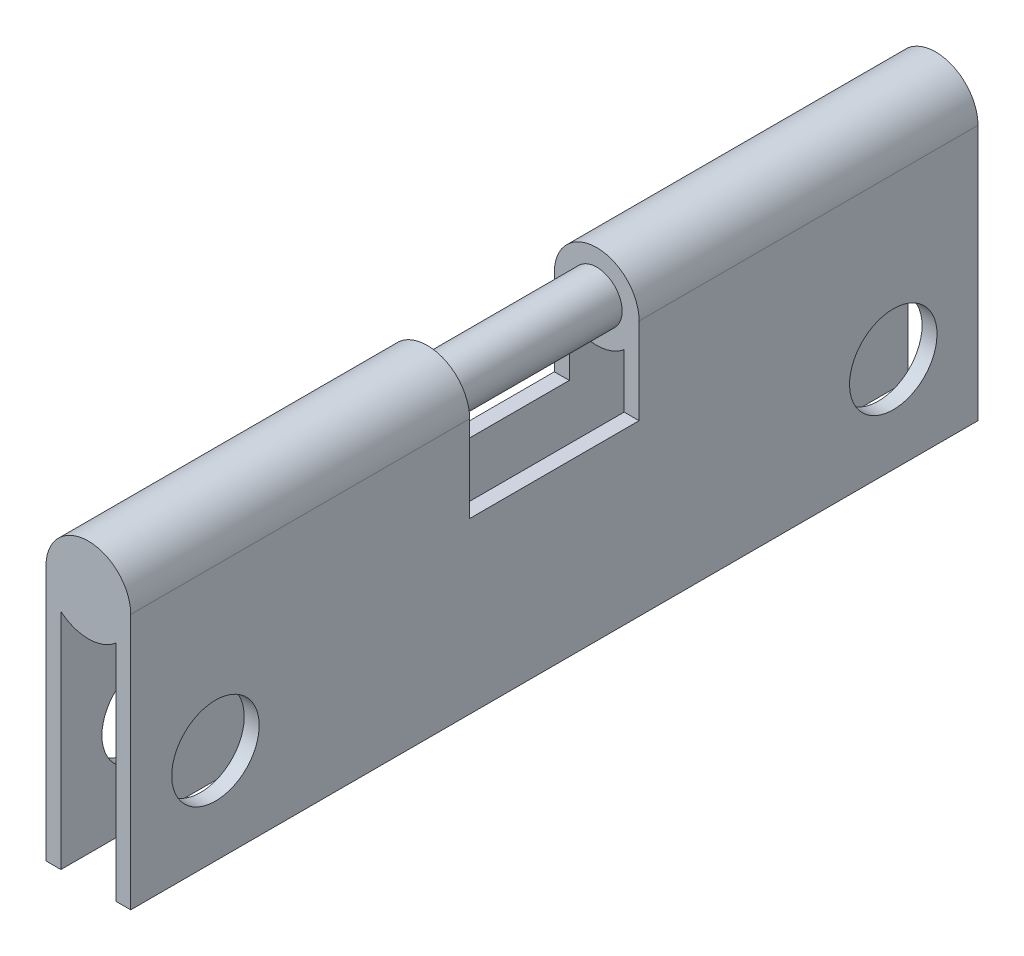
ISO-10303-21;
HEADER;
FILE_DESCRIPTION(('STEP AP214'),'2;1');
FILE_NAME('part.step','',(''),(''),'','','');
FILE_SCHEMA(('AUTOMOTIVE_DESIGN { 1 0 10303 214 1 1 1 1 }'));
ENDSEC;
DATA;
#1=APPLICATION_CONTEXT('core data for automotive mechanical design processes');
#2=APPLICATION_PROTOCOL_DEFINITION('international standard','automotive_design',2000,#1);
#3=PRODUCT_CONTEXT('',#1,'mechanical');
#4=PRODUCT('Part','Part','',(#3));
#5=PRODUCT_RELATED_PRODUCT_CATEGORY('part','',(#4));
#6=PRODUCT_DEFINITION_FORMATION('','',#4);
#7=PRODUCT_DEFINITION_CONTEXT('part definition',#1,'design');
#8=PRODUCT_DEFINITION('design','',#6,#7);
#9=PRODUCT_DEFINITION_SHAPE('','',#8);
#10=(LENGTH_UNIT() NAMED_UNIT(*) SI_UNIT(.MILLI.,.METRE.));
#11=(NAMED_UNIT(*) PLANE_ANGLE_UNIT() SI_UNIT($,.RADIAN.));
#12=(NAMED_UNIT(*) SI_UNIT($,.STERADIAN.) SOLID_ANGLE_UNIT());
#13=UNCERTAINTY_MEASURE_WITH_UNIT(LENGTH_MEASURE(1.E-05),#10,'distance_accuracy_value','');
#14=(GEOMETRIC_REPRESENTATION_CONTEXT(3) GLOBAL_UNCERTAINTY_ASSIGNED_CONTEXT((#13)) GLOBAL_UNIT_ASSIGNED_CONTEXT((#10,
#11,#12)) REPRESENTATION_CONTEXT('',''));
#15=CARTESIAN_POINT('',(0.,0.,0.));
#16=DIRECTION('',(0.,0.,1.));
#17=DIRECTION('',(1.,0.,0.));
#18=AXIS2_PLACEMENT_3D('',#15,#16,#17);
#19=CARTESIAN_POINT('',(0.,0.,31.75));
#20=DIRECTION('',(0.,0.,-1.));
#21=DIRECTION('',(-1.,0.,0.));
#22=AXIS2_PLACEMENT_3D('',#19,#20,#21);
#23=CYLINDRICAL_SURFACE('',#22,1.5875);
#24=DIRECTION('',(0.,0.,-1.));
#25=VECTOR('',#24,1.);
#26=CARTESIAN_POINT('',(1.5875,0.,31.75));
#27=LINE('',#26,#25);
#28=CARTESIAN_POINT('',(1.5875,0.,31.75));
#29=VERTEX_POINT('',#28);
#30=CARTESIAN_POINT('',(1.5875,0.,19.05));
#31=VERTEX_POINT('',#30);
#32=EDGE_CURVE('E301',#29,#31,#27,.T.);
#33=ORIENTED_EDGE('',*,*,#32,.T.);
#34=CARTESIAN_POINT('',(0.,0.,19.05));
#35=DIRECTION('',(0.,0.,1.));
#36=DIRECTION('',(1.,0.,0.));
#37=AXIS2_PLACEMENT_3D('',#34,#35,#36);
#38=CIRCLE('',#37,1.5875);
#39=CARTESIAN_POINT('',(-1.5875,0.,19.05));
#40=VERTEX_POINT('',#39);
#41=EDGE_CURVE('E228',#31,#40,#38,.T.);
#42=ORIENTED_EDGE('',*,*,#41,.T.);
#43=DIRECTION('',(0.,0.,-1.));
#44=VECTOR('',#43,1.);
#45=CARTESIAN_POINT('',(-1.5875,0.,31.75));
#46=LINE('',#45,#44);
#47=CARTESIAN_POINT('',(-1.5875,0.,31.75));
#48=VERTEX_POINT('',#47);
#49=EDGE_CURVE('E177',#48,#40,#46,.T.);
#50=ORIENTED_EDGE('',*,*,#49,.F.);
#51=CARTESIAN_POINT('',(0.,0.,31.75));
#52=DIRECTION('',(0.,0.,1.));
#53=DIRECTION('',(1.,0.,0.));
#54=AXIS2_PLACEMENT_3D('',#51,#52,#53);
#55=CIRCLE('',#54,1.5875);
#56=EDGE_CURVE('E248',#29,#48,#55,.T.);
#57=ORIENTED_EDGE('',*,*,#56,.F.);
#58=EDGE_LOOP('',(#33,#42,#50,#57));
#59=FACE_BOUND('',#58,.T.);
#60=ADVANCED_FACE('F39',(#59),#23,.T.);
#61=CARTESIAN_POINT('',(0.,0.,31.75));
#62=DIRECTION('',(0.,0.,-1.));
#63=DIRECTION('',(-1.,0.,0.));
#64=AXIS2_PLACEMENT_3D('',#61,#62,#63);
#65=CYLINDRICAL_SURFACE('',#64,1.5875);
#66=DIRECTION('',(0.,0.,-1.));
#67=VECTOR('',#66,1.);
#68=CARTESIAN_POINT('',(-1.0287,-1.20910403191785,31.75));
#69=LINE('',#68,#67);
#70=CARTESIAN_POINT('',(-1.0287,-1.20910403191785,31.75));
#71=VERTEX_POINT('',#70);
#72=CARTESIAN_POINT('',(-1.0287,-1.20910403191785,19.05));
#73=VERTEX_POINT('',#72);
#74=EDGE_CURVE('E319',#71,#73,#69,.T.);
#75=ORIENTED_EDGE('',*,*,#74,.T.);
#76=CARTESIAN_POINT('',(0.,0.,19.05));
#77=DIRECTION('',(0.,0.,1.));
#78=DIRECTION('',(1.,0.,0.));
#79=AXIS2_PLACEMENT_3D('',#76,#77,#78);
#80=CIRCLE('',#79,1.5875);
#81=CARTESIAN_POINT('',(1.0287,-1.20910403191785,19.05));
#82=VERTEX_POINT('',#81);
#83=EDGE_CURVE('E222',#73,#82,#80,.T.);
#84=ORIENTED_EDGE('',*,*,#83,.T.);
#85=DIRECTION('',(0.,0.,-1.));
#86=VECTOR('',#85,1.);
#87=CARTESIAN_POINT('',(1.0287,-1.20910403191785,31.75));
#88=LINE('',#87,#86);
#89=CARTESIAN_POINT('',(1.0287,-1.20910403191785,31.75));
#90=VERTEX_POINT('',#89);
#91=EDGE_CURVE('E314',#90,#82,#88,.T.);
#92=ORIENTED_EDGE('',*,*,#91,.F.);
#93=CARTESIAN_POINT('',(0.,0.,31.75));
#94=DIRECTION('',(0.,0.,1.));
#95=DIRECTION('',(1.,0.,0.));
#96=AXIS2_PLACEMENT_3D('',#93,#94,#95);
#97=CIRCLE('',#96,1.5875);
#98=EDGE_CURVE('E262',#71,#90,#97,.T.);
#99=ORIENTED_EDGE('',*,*,#98,.F.);
#100=EDGE_LOOP('',(#75,#84,#92,#99));
#101=FACE_BOUND('',#100,.T.);
#102=ADVANCED_FACE('F403',(#101),#65,.T.);
#103=CARTESIAN_POINT('',(-1.5875,0.,12.7));
#104=VERTEX_POINT('',#103);
#105=CARTESIAN_POINT('',(-1.5875,0.,0.));
#106=VERTEX_POINT('',#105);
#107=EDGE_CURVE('E331',#104,#106,#46,.T.);
#108=ORIENTED_EDGE('',*,*,#107,.F.);
#109=CARTESIAN_POINT('',(0.,0.,12.7));
#110=DIRECTION('',(0.,0.,-1.));
#111=DIRECTION('',(-1.,0.,0.));
#112=AXIS2_PLACEMENT_3D('',#109,#110,#111);
#113=CIRCLE('',#112,1.5875);
#114=CARTESIAN_POINT('',(1.5875,0.,12.7));
#115=VERTEX_POINT('',#114);
#116=EDGE_CURVE('E215',#104,#115,#113,.T.);
#117=ORIENTED_EDGE('',*,*,#116,.T.);
#118=CARTESIAN_POINT('',(1.5875,0.,0.));
#119=VERTEX_POINT('',#118);
#120=EDGE_CURVE('E274',#115,#119,#27,.T.);
#121=ORIENTED_EDGE('',*,*,#120,.T.);
#122=CARTESIAN_POINT('',(0.,0.,0.));
#123=DIRECTION('',(0.,0.,1.));
#124=DIRECTION('',(1.,0.,0.));
#125=AXIS2_PLACEMENT_3D('',#122,#123,#124);
#126=CIRCLE('',#125,1.5875);
#127=EDGE_CURVE('E247',#119,#106,#126,.T.);
#128=ORIENTED_EDGE('',*,*,#127,.T.);
#129=EDGE_LOOP('',(#108,#117,#121,#128));
#130=FACE_BOUND('',#129,.T.);
#131=ADVANCED_FACE('F41',(#130),#23,.T.);
#132=CARTESIAN_POINT('',(-1.5875,0.,31.75));
#133=DIRECTION('',(1.,0.,0.));
#134=DIRECTION('',(0.,1.,0.));
#135=AXIS2_PLACEMENT_3D('',#132,#133,#134);
#136=PLANE('',#135);
#137=CARTESIAN_POINT('',(-1.5875,-6.0071,28.575));
#138=DIRECTION('',(1.,0.,0.));
#139=DIRECTION('',(0.,1.,0.));
#140=AXIS2_PLACEMENT_3D('',#137,#138,#139);
#141=CIRCLE('',#140,1.6383);
#142=CARTESIAN_POINT('',(-1.5875,-4.3688,28.575));
#143=VERTEX_POINT('',#142);
#144=EDGE_CURVE('E200',#143,#143,#141,.T.);
#145=ORIENTED_EDGE('',*,*,#144,.T.);
#146=EDGE_LOOP('',(#145));
#147=FACE_BOUND('',#146,.T.);
#148=CARTESIAN_POINT('',(-1.5875,-6.0071,3.175));
#149=DIRECTION('',(1.,0.,0.));
#150=DIRECTION('',(0.,1.,0.));
#151=AXIS2_PLACEMENT_3D('',#148,#149,#150);
#152=CIRCLE('',#151,1.6383);
#153=CARTESIAN_POINT('',(-1.5875,-4.3688,3.175));
#154=VERTEX_POINT('',#153);
#155=EDGE_CURVE('E363',#154,#154,#152,.T.);
#156=ORIENTED_EDGE('',*,*,#155,.T.);
#157=EDGE_LOOP('',(#156));
#158=FACE_BOUND('',#157,.T.);
#159=ORIENTED_EDGE('',*,*,#49,.T.);
#160=DIRECTION('',(0.,-1.,0.));
#161=VECTOR('',#160,1.);
#162=CARTESIAN_POINT('',(-1.5875,1.5875,19.05));
#163=LINE('',#162,#161);
#164=CARTESIAN_POINT('',(-1.5875,-3.2385,19.05));
#165=VERTEX_POINT('',#164);
#166=EDGE_CURVE('E156',#40,#165,#163,.T.);
#167=ORIENTED_EDGE('',*,*,#166,.T.);
#168=DIRECTION('',(0.,0.,-1.));
#169=VECTOR('',#168,1.);
#170=CARTESIAN_POINT('',(-1.5875,-3.2385,19.05));
#171=LINE('',#170,#169);
#172=CARTESIAN_POINT('',(-1.5875,-3.2385,12.7));
#173=VERTEX_POINT('',#172);
#174=EDGE_CURVE('E165',#165,#173,#171,.T.);
#175=ORIENTED_EDGE('',*,*,#174,.T.);
#176=DIRECTION('',(0.,1.,0.));
#177=VECTOR('',#176,1.);
#178=CARTESIAN_POINT('',(-1.5875,1.5875,12.7));
#179=LINE('',#178,#177);
#180=EDGE_CURVE('E173',#173,#104,#179,.T.);
#181=ORIENTED_EDGE('',*,*,#180,.T.);
#182=ORIENTED_EDGE('',*,*,#107,.T.);
#183=DIRECTION('',(0.,-1.,0.));
#184=VECTOR('',#183,1.);
#185=CARTESIAN_POINT('',(-1.5875,0.,0.));
#186=LINE('',#185,#184);
#187=CARTESIAN_POINT('',(-1.5875,-9.5885,0.));
#188=VERTEX_POINT('',#187);
#189=EDGE_CURVE('E278',#106,#188,#186,.T.);
#190=ORIENTED_EDGE('',*,*,#189,.T.);
#191=DIRECTION('',(0.,0.,-1.));
#192=VECTOR('',#191,1.);
#193=CARTESIAN_POINT('',(-1.5875,-9.5885,31.75));
#194=LINE('',#193,#192);
#195=CARTESIAN_POINT('',(-1.5875,-9.5885,31.75));
#196=VERTEX_POINT('',#195);
#197=EDGE_CURVE('E327',#196,#188,#194,.T.);
#198=ORIENTED_EDGE('',*,*,#197,.F.);
#199=DIRECTION('',(0.,-1.,0.));
#200=VECTOR('',#199,1.);
#201=CARTESIAN_POINT('',(-1.5875,0.,31.75));
#202=LINE('',#201,#200);
#203=EDGE_CURVE('E252',#48,#196,#202,.T.);
#204=ORIENTED_EDGE('',*,*,#203,.F.);
#205=EDGE_LOOP('',(#159,#167,#175,#181,#182,#190,#198,#204));
#206=FACE_BOUND('',#205,.T.);
#207=ADVANCED_FACE('F175',(#147,#158,#206),#136,.F.);
#208=CARTESIAN_POINT('',(-1.5875,-9.5885,31.75));
#209=DIRECTION('',(0.,1.,0.));
#210=DIRECTION('',(0.,0.,1.));
#211=AXIS2_PLACEMENT_3D('',#208,#209,#210);
#212=PLANE('',#211);
#213=DIRECTION('',(1.,0.,0.));
#214=VECTOR('',#213,1.);
#215=CARTESIAN_POINT('',(-1.5875,-9.5885,0.));
#216=LINE('',#215,#214);
#217=CARTESIAN_POINT('',(-1.0287,-9.5885,0.));
#218=VERTEX_POINT('',#217);
#219=EDGE_CURVE('E281',#188,#218,#216,.T.);
#220=ORIENTED_EDGE('',*,*,#219,.T.);
#221=DIRECTION('',(0.,0.,-1.));
#222=VECTOR('',#221,1.);
#223=CARTESIAN_POINT('',(-1.0287,-9.5885,31.75));
#224=LINE('',#223,#222);
#225=CARTESIAN_POINT('',(-1.0287,-9.5885,31.75));
#226=VERTEX_POINT('',#225);
#227=EDGE_CURVE('E323',#226,#218,#224,.T.);
#228=ORIENTED_EDGE('',*,*,#227,.F.);
#229=DIRECTION('',(1.,0.,0.));
#230=VECTOR('',#229,1.);
#231=CARTESIAN_POINT('',(-1.5875,-9.5885,31.75));
#232=LINE('',#231,#230);
#233=EDGE_CURVE('E256',#196,#226,#232,.T.);
#234=ORIENTED_EDGE('',*,*,#233,.F.);
#235=ORIENTED_EDGE('',*,*,#197,.T.);
#236=EDGE_LOOP('',(#220,#228,#234,#235));
#237=FACE_BOUND('',#236,.T.);
#238=ADVANCED_FACE('F387',(#237),#212,.F.);
#239=CARTESIAN_POINT('',(-1.0287,-9.5885,31.75));
#240=DIRECTION('',(-1.,0.,0.));
#241=DIRECTION('',(0.,0.,1.));
#242=AXIS2_PLACEMENT_3D('',#239,#240,#241);
#243=PLANE('',#242);
#244=CARTESIAN_POINT('',(-1.0287,-6.0071,28.575));
#245=DIRECTION('',(-1.,0.,0.));
#246=DIRECTION('',(0.,0.,1.));
#247=AXIS2_PLACEMENT_3D('',#244,#245,#246);
#248=CIRCLE('',#247,1.6383);
#249=CARTESIAN_POINT('',(-1.0287,-6.0071,30.2133));
#250=VERTEX_POINT('',#249);
#251=EDGE_CURVE('E243',#250,#250,#248,.T.);
#252=ORIENTED_EDGE('',*,*,#251,.T.);
#253=EDGE_LOOP('',(#252));
#254=FACE_BOUND('',#253,.T.);
#255=CARTESIAN_POINT('',(-1.0287,-6.0071,3.175));
#256=DIRECTION('',(-1.,0.,0.));
#257=DIRECTION('',(0.,0.,1.));
#258=AXIS2_PLACEMENT_3D('',#255,#256,#257);
#259=CIRCLE('',#258,1.6383);
#260=CARTESIAN_POINT('',(-1.0287,-6.0071,4.8133));
#261=VERTEX_POINT('',#260);
#262=EDGE_CURVE('E235',#261,#261,#259,.T.);
#263=ORIENTED_EDGE('',*,*,#262,.T.);
#264=EDGE_LOOP('',(#263));
#265=FACE_BOUND('',#264,.T.);
#266=DIRECTION('',(0.,0.,1.));
#267=VECTOR('',#266,1.);
#268=CARTESIAN_POINT('',(-1.0287,-3.2385,31.75));
#269=LINE('',#268,#267);
#270=CARTESIAN_POINT('',(-1.0287,-3.2385,12.7));
#271=VERTEX_POINT('',#270);
#272=CARTESIAN_POINT('',(-1.0287,-3.2385,19.05));
#273=VERTEX_POINT('',#272);
#274=EDGE_CURVE('E199',#271,#273,#269,.T.);
#275=ORIENTED_EDGE('',*,*,#274,.T.);
#276=DIRECTION('',(0.,1.,0.));
#277=VECTOR('',#276,1.);
#278=CARTESIAN_POINT('',(-1.0287,-9.5885,19.05));
#279=LINE('',#278,#277);
#280=EDGE_CURVE('E159',#273,#73,#279,.T.);
#281=ORIENTED_EDGE('',*,*,#280,.T.);
#282=ORIENTED_EDGE('',*,*,#74,.F.);
#283=DIRECTION('',(0.,1.,0.));
#284=VECTOR('',#283,1.);
#285=CARTESIAN_POINT('',(-1.0287,-9.5885,31.75));
#286=LINE('',#285,#284);
#287=EDGE_CURVE('E259',#226,#71,#286,.T.);
#288=ORIENTED_EDGE('',*,*,#287,.F.);
#289=ORIENTED_EDGE('',*,*,#227,.T.);
#290=DIRECTION('',(0.,1.,0.));
#291=VECTOR('',#290,1.);
#292=CARTESIAN_POINT('',(-1.0287,-9.5885,0.));
#293=LINE('',#292,#291);
#294=CARTESIAN_POINT('',(-1.0287,-1.20910403191785,0.));
#295=VERTEX_POINT('',#294);
#296=EDGE_CURVE('E284',#218,#295,#293,.T.);
#297=ORIENTED_EDGE('',*,*,#296,.T.);
#298=CARTESIAN_POINT('',(-1.0287,-1.20910403191785,12.7));
#299=VERTEX_POINT('',#298);
#300=EDGE_CURVE('E318',#299,#295,#69,.T.);
#301=ORIENTED_EDGE('',*,*,#300,.F.);
#302=DIRECTION('',(0.,-1.,0.));
#303=VECTOR('',#302,1.);
#304=CARTESIAN_POINT('',(-1.0287,-9.5885,12.7));
#305=LINE('',#304,#303);
#306=EDGE_CURVE('E211',#299,#271,#305,.T.);
#307=ORIENTED_EDGE('',*,*,#306,.T.);
#308=EDGE_LOOP('',(#275,#281,#282,#288,#289,#297,#301,#307));
#309=FACE_BOUND('',#308,.T.);
#310=ADVANCED_FACE('F405',(#254,#265,#309),#243,.F.);
#311=CARTESIAN_POINT('',(1.0287,-1.20910403191785,12.7));
#312=VERTEX_POINT('',#311);
#313=CARTESIAN_POINT('',(1.0287,-1.20910403191785,0.));
#314=VERTEX_POINT('',#313);
#315=EDGE_CURVE('E313',#312,#314,#88,.T.);
#316=ORIENTED_EDGE('',*,*,#315,.F.);
#317=CARTESIAN_POINT('',(0.,0.,12.7));
#318=DIRECTION('',(0.,0.,-1.));
#319=DIRECTION('',(-1.,0.,0.));
#320=AXIS2_PLACEMENT_3D('',#317,#318,#319);
#321=CIRCLE('',#320,1.5875);
#322=EDGE_CURVE('E207',#312,#299,#321,.T.);
#323=ORIENTED_EDGE('',*,*,#322,.T.);
#324=ORIENTED_EDGE('',*,*,#300,.T.);
#325=CARTESIAN_POINT('',(0.,0.,0.));
#326=DIRECTION('',(0.,0.,1.));
#327=DIRECTION('',(1.,0.,0.));
#328=AXIS2_PLACEMENT_3D('',#325,#326,#327);
#329=CIRCLE('',#328,1.5875);
#330=EDGE_CURVE('E288',#295,#314,#329,.T.);
#331=ORIENTED_EDGE('',*,*,#330,.T.);
#332=EDGE_LOOP('',(#316,#323,#324,#331));
#333=FACE_BOUND('',#332,.T.);
#334=ADVANCED_FACE('F409',(#333),#65,.T.);
#335=CARTESIAN_POINT('',(1.0287,-9.5885,31.75));
#336=DIRECTION('',(1.,0.,0.));
#337=DIRECTION('',(0.,0.,-1.));
#338=AXIS2_PLACEMENT_3D('',#335,#336,#337);
#339=PLANE('',#338);
#340=CARTESIAN_POINT('',(1.0287,-6.0071,28.575));
#341=DIRECTION('',(1.,0.,0.));
#342=DIRECTION('',(0.,0.,-1.));
#343=AXIS2_PLACEMENT_3D('',#340,#341,#342);
#344=CIRCLE('',#343,1.6383);
#345=CARTESIAN_POINT('',(1.0287,-6.0071,26.9367));
#346=VERTEX_POINT('',#345);
#347=EDGE_CURVE('E239',#346,#346,#344,.T.);
#348=ORIENTED_EDGE('',*,*,#347,.T.);
#349=EDGE_LOOP('',(#348));
#350=FACE_BOUND('',#349,.T.);
#351=CARTESIAN_POINT('',(1.0287,-6.0071,3.175));
#352=DIRECTION('',(1.,0.,0.));
#353=DIRECTION('',(0.,0.,-1.));
#354=AXIS2_PLACEMENT_3D('',#351,#352,#353);
#355=CIRCLE('',#354,1.6383);
#356=CARTESIAN_POINT('',(1.0287,-6.0071,1.5367));
#357=VERTEX_POINT('',#356);
#358=EDGE_CURVE('E231',#357,#357,#355,.T.);
#359=ORIENTED_EDGE('',*,*,#358,.T.);
#360=EDGE_LOOP('',(#359));
#361=FACE_BOUND('',#360,.T.);
#362=ORIENTED_EDGE('',*,*,#91,.T.);
#363=DIRECTION('',(0.,-1.,0.));
#364=VECTOR('',#363,1.);
#365=CARTESIAN_POINT('',(1.0287,-9.5885,19.05));
#366=LINE('',#365,#364);
#367=CARTESIAN_POINT('',(1.0287,-3.2385,19.05));
#368=VERTEX_POINT('',#367);
#369=EDGE_CURVE('E218',#82,#368,#366,.T.);
#370=ORIENTED_EDGE('',*,*,#369,.T.);
#371=DIRECTION('',(0.,0.,-1.));
#372=VECTOR('',#371,1.);
#373=CARTESIAN_POINT('',(1.0287,-3.2385,31.75));
#374=LINE('',#373,#372);
#375=CARTESIAN_POINT('',(1.0287,-3.2385,12.7));
#376=VERTEX_POINT('',#375);
#377=EDGE_CURVE('E195',#368,#376,#374,.T.);
#378=ORIENTED_EDGE('',*,*,#377,.T.);
#379=DIRECTION('',(0.,1.,0.));
#380=VECTOR('',#379,1.);
#381=CARTESIAN_POINT('',(1.0287,-9.5885,12.7));
#382=LINE('',#381,#380);
#383=EDGE_CURVE('E203',#376,#312,#382,.T.);
#384=ORIENTED_EDGE('',*,*,#383,.T.);
#385=ORIENTED_EDGE('',*,*,#315,.T.);
#386=DIRECTION('',(0.,-1.,0.));
#387=VECTOR('',#386,1.);
#388=CARTESIAN_POINT('',(1.0287,-9.5885,0.));
#389=LINE('',#388,#387);
#390=CARTESIAN_POINT('',(1.0287,-9.5885,0.));
#391=VERTEX_POINT('',#390);
#392=EDGE_CURVE('E292',#314,#391,#389,.T.);
#393=ORIENTED_EDGE('',*,*,#392,.T.);
#394=DIRECTION('',(0.,0.,-1.));
#395=VECTOR('',#394,1.);
#396=CARTESIAN_POINT('',(1.0287,-9.5885,31.75));
#397=LINE('',#396,#395);
#398=CARTESIAN_POINT('',(1.0287,-9.5885,31.75));
#399=VERTEX_POINT('',#398);
#400=EDGE_CURVE('E309',#399,#391,#397,.T.);
#401=ORIENTED_EDGE('',*,*,#400,.F.);
#402=DIRECTION('',(0.,-1.,0.));
#403=VECTOR('',#402,1.);
#404=CARTESIAN_POINT('',(1.0287,-9.5885,31.75));
#405=LINE('',#404,#403);
#406=EDGE_CURVE('E265',#90,#399,#405,.T.);
#407=ORIENTED_EDGE('',*,*,#406,.F.);
#408=EDGE_LOOP('',(#362,#370,#378,#384,#385,#393,#401,#407));
#409=FACE_BOUND('',#408,.T.);
#410=ADVANCED_FACE('F397',(#350,#361,#409),#339,.F.);
#411=CARTESIAN_POINT('',(1.5875,-9.5885,31.75));
#412=DIRECTION('',(0.,1.,0.));
#413=DIRECTION('',(0.,0.,1.));
#414=AXIS2_PLACEMENT_3D('',#411,#412,#413);
#415=PLANE('',#414);
#416=DIRECTION('',(1.,0.,0.));
#417=VECTOR('',#416,1.);
#418=CARTESIAN_POINT('',(1.5875,-9.5885,0.));
#419=LINE('',#418,#417);
#420=CARTESIAN_POINT('',(1.5875,-9.5885,0.));
#421=VERTEX_POINT('',#420);
#422=EDGE_CURVE('E295',#391,#421,#419,.T.);
#423=ORIENTED_EDGE('',*,*,#422,.T.);
#424=DIRECTION('',(0.,0.,-1.));
#425=VECTOR('',#424,1.);
#426=CARTESIAN_POINT('',(1.5875,-9.5885,31.75));
#427=LINE('',#426,#425);
#428=CARTESIAN_POINT('',(1.5875,-9.5885,31.75));
#429=VERTEX_POINT('',#428);
#430=EDGE_CURVE('E305',#429,#421,#427,.T.);
#431=ORIENTED_EDGE('',*,*,#430,.F.);
#432=DIRECTION('',(1.,0.,0.));
#433=VECTOR('',#432,1.);
#434=CARTESIAN_POINT('',(1.5875,-9.5885,31.75));
#435=LINE('',#434,#433);
#436=EDGE_CURVE('E268',#399,#429,#435,.T.);
#437=ORIENTED_EDGE('',*,*,#436,.F.);
#438=ORIENTED_EDGE('',*,*,#400,.T.);
#439=EDGE_LOOP('',(#423,#431,#437,#438));
#440=FACE_BOUND('',#439,.T.);
#441=ADVANCED_FACE('F414',(#440),#415,.F.);
#442=CARTESIAN_POINT('',(1.5875,0.,31.75));
#443=DIRECTION('',(-1.,0.,0.));
#444=DIRECTION('',(0.,-1.,0.));
#445=AXIS2_PLACEMENT_3D('',#442,#443,#444);
#446=PLANE('',#445);
#447=CARTESIAN_POINT('',(1.5875,-6.0071,28.575));
#448=DIRECTION('',(1.,0.,0.));
#449=DIRECTION('',(0.,1.,0.));
#450=AXIS2_PLACEMENT_3D('',#447,#448,#449);
#451=CIRCLE('',#450,1.6383);
#452=CARTESIAN_POINT('',(1.5875,-4.3688,28.575));
#453=VERTEX_POINT('',#452);
#454=EDGE_CURVE('E359',#453,#453,#451,.T.);
#455=ORIENTED_EDGE('',*,*,#454,.F.);
#456=EDGE_LOOP('',(#455));
#457=FACE_BOUND('',#456,.T.);
#458=CARTESIAN_POINT('',(1.5875,-6.0071,3.175));
#459=DIRECTION('',(1.,0.,0.));
#460=DIRECTION('',(0.,1.,0.));
#461=AXIS2_PLACEMENT_3D('',#458,#459,#460);
#462=CIRCLE('',#461,1.6383);
#463=CARTESIAN_POINT('',(1.5875,-4.3688,3.175));
#464=VERTEX_POINT('',#463);
#465=EDGE_CURVE('E186',#464,#464,#462,.T.);
#466=ORIENTED_EDGE('',*,*,#465,.F.);
#467=EDGE_LOOP('',(#466));
#468=FACE_BOUND('',#467,.T.);
#469=DIRECTION('',(0.,0.,-1.));
#470=VECTOR('',#469,1.);
#471=CARTESIAN_POINT('',(1.5875,-3.2385,19.05));
#472=LINE('',#471,#470);
#473=CARTESIAN_POINT('',(1.5875,-3.2385,19.05));
#474=VERTEX_POINT('',#473);
#475=CARTESIAN_POINT('',(1.5875,-3.2385,12.7));
#476=VERTEX_POINT('',#475);
#477=EDGE_CURVE('E183',#474,#476,#472,.T.);
#478=ORIENTED_EDGE('',*,*,#477,.F.);
#479=DIRECTION('',(0.,1.,0.));
#480=VECTOR('',#479,1.);
#481=CARTESIAN_POINT('',(1.5875,0.,19.05));
#482=LINE('',#481,#480);
#483=EDGE_CURVE('E334',#474,#31,#482,.T.);
#484=ORIENTED_EDGE('',*,*,#483,.T.);
#485=ORIENTED_EDGE('',*,*,#32,.F.);
#486=DIRECTION('',(0.,1.,0.));
#487=VECTOR('',#486,1.);
#488=CARTESIAN_POINT('',(1.5875,0.,31.75));
#489=LINE('',#488,#487);
#490=EDGE_CURVE('E271',#429,#29,#489,.T.);
#491=ORIENTED_EDGE('',*,*,#490,.F.);
#492=ORIENTED_EDGE('',*,*,#430,.T.);
#493=DIRECTION('',(0.,1.,0.));
#494=VECTOR('',#493,1.);
#495=CARTESIAN_POINT('',(1.5875,0.,0.));
#496=LINE('',#495,#494);
#497=EDGE_CURVE('E253',#421,#119,#496,.T.);
#498=ORIENTED_EDGE('',*,*,#497,.T.);
#499=ORIENTED_EDGE('',*,*,#120,.F.);
#500=DIRECTION('',(0.,1.,0.));
#501=VECTOR('',#500,1.);
#502=CARTESIAN_POINT('',(1.5875,1.5875,12.7));
#503=LINE('',#502,#501);
#504=EDGE_CURVE('E179',#476,#115,#503,.T.);
#505=ORIENTED_EDGE('',*,*,#504,.F.);
#506=EDGE_LOOP('',(#478,#484,#485,#491,#492,#498,#499,#505));
#507=FACE_BOUND('',#506,.T.);
#508=ADVANCED_FACE('F375',(#457,#468,#507),#446,.F.);
#509=CARTESIAN_POINT('',(0.,0.,31.75));
#510=DIRECTION('',(0.,0.,1.));
#511=DIRECTION('',(1.,0.,0.));
#512=AXIS2_PLACEMENT_3D('',#509,#510,#511);
#513=PLANE('',#512);
#514=ORIENTED_EDGE('',*,*,#56,.T.);
#515=ORIENTED_EDGE('',*,*,#203,.T.);
#516=ORIENTED_EDGE('',*,*,#233,.T.);
#517=ORIENTED_EDGE('',*,*,#287,.T.);
#518=ORIENTED_EDGE('',*,*,#98,.T.);
#519=ORIENTED_EDGE('',*,*,#406,.T.);
#520=ORIENTED_EDGE('',*,*,#436,.T.);
#521=ORIENTED_EDGE('',*,*,#490,.T.);
#522=EDGE_LOOP('',(#514,#515,#516,#517,#518,#519,#520,#521));
#523=FACE_BOUND('',#522,.T.);
#524=ADVANCED_FACE('F391',(#523),#513,.T.);
#525=CARTESIAN_POINT('',(0.,0.,0.));
#526=DIRECTION('',(0.,0.,1.));
#527=DIRECTION('',(1.,0.,0.));
#528=AXIS2_PLACEMENT_3D('',#525,#526,#527);
#529=PLANE('',#528);
#530=ORIENTED_EDGE('',*,*,#127,.F.);
#531=ORIENTED_EDGE('',*,*,#497,.F.);
#532=ORIENTED_EDGE('',*,*,#422,.F.);
#533=ORIENTED_EDGE('',*,*,#392,.F.);
#534=ORIENTED_EDGE('',*,*,#330,.F.);
#535=ORIENTED_EDGE('',*,*,#296,.F.);
#536=ORIENTED_EDGE('',*,*,#219,.F.);
#537=ORIENTED_EDGE('',*,*,#189,.F.);
#538=EDGE_LOOP('',(#530,#531,#532,#533,#534,#535,#536,#537));
#539=FACE_BOUND('',#538,.T.);
#540=ADVANCED_FACE('F381',(#539),#529,.F.);
#541=CARTESIAN_POINT('',(-1.5875,1.5875,19.05));
#542=DIRECTION('',(0.,0.,1.));
#543=DIRECTION('',(1.,0.,0.));
#544=AXIS2_PLACEMENT_3D('',#541,#542,#543);
#545=PLANE('',#544);
#546=CARTESIAN_POINT('',(0.,0.,19.05));
#547=DIRECTION('',(0.,0.,1.));
#548=DIRECTION('',(1.,0.,0.));
#549=AXIS2_PLACEMENT_3D('',#546,#547,#548);
#550=CIRCLE('',#549,0.9525);
#551=CARTESIAN_POINT('',(0.9525,0.,19.05));
#552=VERTEX_POINT('',#551);
#553=EDGE_CURVE('E11',#552,#552,#550,.F.);
#554=ORIENTED_EDGE('',*,*,#553,.F.);
#555=EDGE_LOOP('',(#554));
#556=FACE_BOUND('',#555,.T.);
#557=ORIENTED_EDGE('',*,*,#483,.F.);
#558=DIRECTION('',(1.,0.,0.));
#559=VECTOR('',#558,1.);
#560=CARTESIAN_POINT('',(-1.5875,-3.2385,19.05));
#561=LINE('',#560,#559);
#562=EDGE_CURVE('E60',#368,#474,#561,.T.);
#563=ORIENTED_EDGE('',*,*,#562,.F.);
#564=ORIENTED_EDGE('',*,*,#369,.F.);
#565=ORIENTED_EDGE('',*,*,#83,.F.);
#566=ORIENTED_EDGE('',*,*,#280,.F.);
#567=EDGE_CURVE('E152',#165,#273,#561,.T.);
#568=ORIENTED_EDGE('',*,*,#567,.F.);
#569=ORIENTED_EDGE('',*,*,#166,.F.);
#570=ORIENTED_EDGE('',*,*,#41,.F.);
#571=EDGE_LOOP('',(#557,#563,#564,#565,#566,#568,#569,#570));
#572=FACE_BOUND('',#571,.T.);
#573=ADVANCED_FACE('F154',(#556,#572),#545,.F.);
#574=CARTESIAN_POINT('',(-1.5875,1.5875,12.7));
#575=DIRECTION('',(0.,0.,-1.));
#576=DIRECTION('',(-1.,0.,0.));
#577=AXIS2_PLACEMENT_3D('',#574,#575,#576);
#578=PLANE('',#577);
#579=CARTESIAN_POINT('',(0.,0.,12.7));
#580=DIRECTION('',(0.,0.,-1.));
#581=DIRECTION('',(-1.,0.,0.));
#582=AXIS2_PLACEMENT_3D('',#579,#580,#581);
#583=CIRCLE('',#582,0.9525);
#584=CARTESIAN_POINT('',(-0.9525,0.,12.7));
#585=VERTEX_POINT('',#584);
#586=EDGE_CURVE('E48',#585,#585,#583,.F.);
#587=ORIENTED_EDGE('',*,*,#586,.F.);
#588=EDGE_LOOP('',(#587));
#589=FACE_BOUND('',#588,.T.);
#590=ORIENTED_EDGE('',*,*,#180,.F.);
#591=DIRECTION('',(1.,0.,0.));
#592=VECTOR('',#591,1.);
#593=CARTESIAN_POINT('',(-1.5875,-3.2385,12.7));
#594=LINE('',#593,#592);
#595=EDGE_CURVE('E168',#173,#271,#594,.T.);
#596=ORIENTED_EDGE('',*,*,#595,.T.);
#597=ORIENTED_EDGE('',*,*,#306,.F.);
#598=ORIENTED_EDGE('',*,*,#322,.F.);
#599=ORIENTED_EDGE('',*,*,#383,.F.);
#600=EDGE_CURVE('E55',#376,#476,#594,.T.);
#601=ORIENTED_EDGE('',*,*,#600,.T.);
#602=ORIENTED_EDGE('',*,*,#504,.T.);
#603=ORIENTED_EDGE('',*,*,#116,.F.);
#604=EDGE_LOOP('',(#590,#596,#597,#598,#599,#601,#602,#603));
#605=FACE_BOUND('',#604,.T.);
#606=ADVANCED_FACE('F344',(#589,#605),#578,.F.);
#607=CARTESIAN_POINT('',(-1.5875,-3.2385,19.05));
#608=DIRECTION('',(0.,-1.,0.));
#609=DIRECTION('',(1.,0.,0.));
#610=AXIS2_PLACEMENT_3D('',#607,#608,#609);
#611=PLANE('',#610);
#612=ORIENTED_EDGE('',*,*,#595,.F.);
#613=ORIENTED_EDGE('',*,*,#174,.F.);
#614=ORIENTED_EDGE('',*,*,#567,.T.);
#615=ORIENTED_EDGE('',*,*,#274,.F.);
#616=EDGE_LOOP('',(#612,#613,#614,#615));
#617=FACE_BOUND('',#616,.T.);
#618=ADVANCED_FACE('F166',(#617),#611,.F.);
#619=ORIENTED_EDGE('',*,*,#562,.T.);
#620=ORIENTED_EDGE('',*,*,#477,.T.);
#621=ORIENTED_EDGE('',*,*,#600,.F.);
#622=ORIENTED_EDGE('',*,*,#377,.F.);
#623=EDGE_LOOP('',(#619,#620,#621,#622));
#624=FACE_BOUND('',#623,.T.);
#625=ADVANCED_FACE('F373',(#624),#611,.F.);
#626=CARTESIAN_POINT('',(-1.5875,-6.0071,3.175));
#627=DIRECTION('',(1.,0.,0.));
#628=DIRECTION('',(0.,1.,0.));
#629=AXIS2_PLACEMENT_3D('',#626,#627,#628);
#630=CYLINDRICAL_SURFACE('',#629,1.6383);
#631=ORIENTED_EDGE('',*,*,#465,.T.);
#632=EDGE_LOOP('',(#631));
#633=FACE_BOUND('',#632,.T.);
#634=ORIENTED_EDGE('',*,*,#358,.F.);
#635=EDGE_LOOP('',(#634));
#636=FACE_BOUND('',#635,.T.);
#637=ADVANCED_FACE('F479',(#633,#636),#630,.F.);
#638=CARTESIAN_POINT('',(-1.5875,-6.0071,28.575));
#639=DIRECTION('',(1.,0.,0.));
#640=DIRECTION('',(0.,1.,0.));
#641=AXIS2_PLACEMENT_3D('',#638,#639,#640);
#642=CYLINDRICAL_SURFACE('',#641,1.6383);
#643=ORIENTED_EDGE('',*,*,#454,.T.);
#644=EDGE_LOOP('',(#643));
#645=FACE_BOUND('',#644,.T.);
#646=ORIENTED_EDGE('',*,*,#347,.F.);
#647=EDGE_LOOP('',(#646));
#648=FACE_BOUND('',#647,.T.);
#649=ADVANCED_FACE('F487',(#645,#648),#642,.F.);
#650=ORIENTED_EDGE('',*,*,#155,.F.);
#651=EDGE_LOOP('',(#650));
#652=FACE_BOUND('',#651,.T.);
#653=ORIENTED_EDGE('',*,*,#262,.F.);
#654=EDGE_LOOP('',(#653));
#655=FACE_BOUND('',#654,.T.);
#656=ADVANCED_FACE('F490',(#652,#655),#630,.F.);
#657=ORIENTED_EDGE('',*,*,#144,.F.);
#658=EDGE_LOOP('',(#657));
#659=FACE_BOUND('',#658,.T.);
#660=ORIENTED_EDGE('',*,*,#251,.F.);
#661=EDGE_LOOP('',(#660));
#662=FACE_BOUND('',#661,.T.);
#663=ADVANCED_FACE('F500',(#659,#662),#642,.F.);
#664=CARTESIAN_POINT('',(0.,0.,31.752));
#665=DIRECTION('',(0.,0.,-1.));
#666=DIRECTION('',(-1.,0.,0.));
#667=AXIS2_PLACEMENT_3D('',#664,#665,#666);
#668=CYLINDRICAL_SURFACE('',#667,0.9525);
#669=ORIENTED_EDGE('',*,*,#586,.T.);
#670=EDGE_LOOP('',(#669));
#671=FACE_BOUND('',#670,.T.);
#672=ORIENTED_EDGE('',*,*,#553,.T.);
#673=EDGE_LOOP('',(#672));
#674=FACE_BOUND('',#673,.T.);
#675=ADVANCED_FACE('F341',(#671,#674),#668,.T.);
#676=CLOSED_SHELL('',(#60,#102,#131,#207,#238,#310,#334,#410,#441,#508,#524,#540,#573,#606,#618,
#625,#637,#649,#656,#663,#675));
#677=MANIFOLD_SOLID_BREP('B2',#676);
#678=ADVANCED_BREP_SHAPE_REPRESENTATION('',(#18,#677),#14);
#679=SHAPE_DEFINITION_REPRESENTATION(#9,#678);
ENDSEC;
END-ISO-10303-21;
